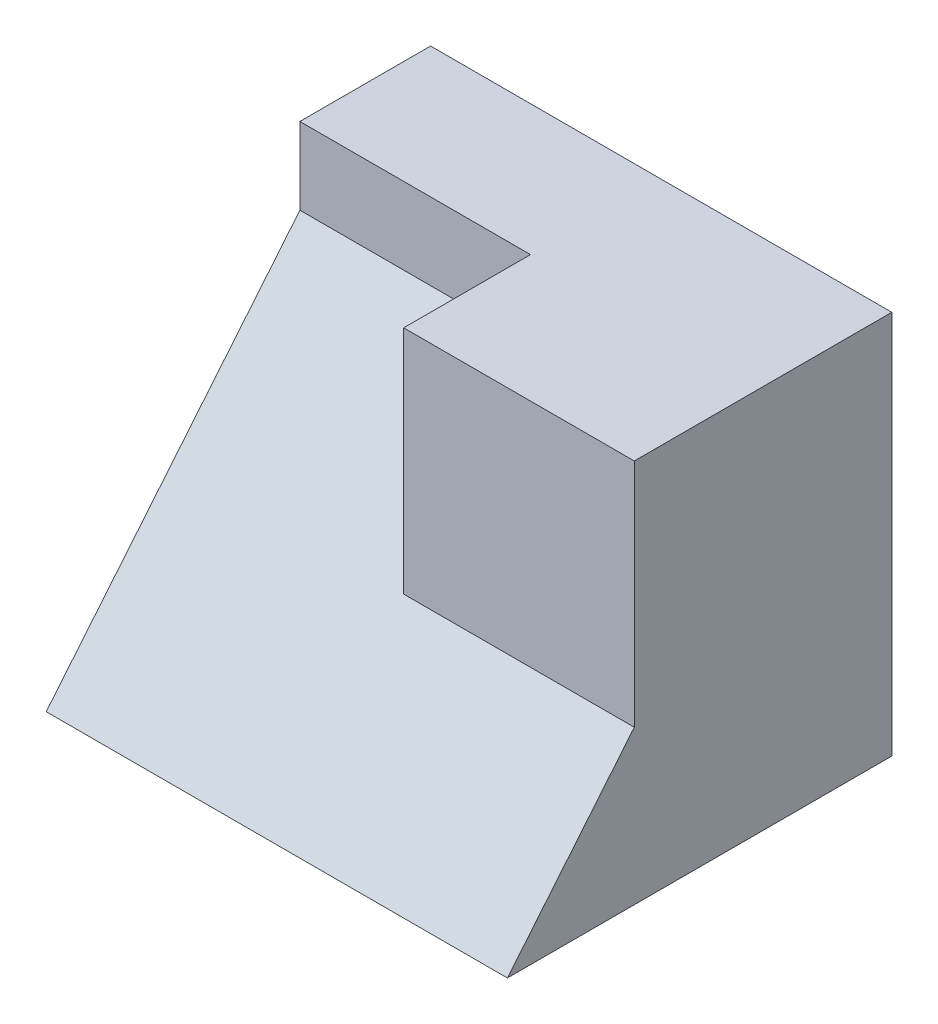
ISO-10303-21;
HEADER;
FILE_DESCRIPTION(('STEP AP214'),'2;1');
FILE_NAME('part.step','',(''),(''),'','','');
FILE_SCHEMA(('AUTOMOTIVE_DESIGN { 1 0 10303 214 1 1 1 1 }'));
ENDSEC;
DATA;
#1=APPLICATION_CONTEXT('core data for automotive mechanical design processes');
#2=APPLICATION_PROTOCOL_DEFINITION('international standard','automotive_design',2000,#1);
#3=PRODUCT_CONTEXT('',#1,'mechanical');
#4=PRODUCT('Part','Part','',(#3));
#5=PRODUCT_RELATED_PRODUCT_CATEGORY('part','',(#4));
#6=PRODUCT_DEFINITION_FORMATION('','',#4);
#7=PRODUCT_DEFINITION_CONTEXT('part definition',#1,'design');
#8=PRODUCT_DEFINITION('design','',#6,#7);
#9=PRODUCT_DEFINITION_SHAPE('','',#8);
#10=(LENGTH_UNIT() NAMED_UNIT(*) SI_UNIT(.MILLI.,.METRE.));
#11=(NAMED_UNIT(*) PLANE_ANGLE_UNIT() SI_UNIT($,.RADIAN.));
#12=(NAMED_UNIT(*) SI_UNIT($,.STERADIAN.) SOLID_ANGLE_UNIT());
#13=UNCERTAINTY_MEASURE_WITH_UNIT(LENGTH_MEASURE(1.E-05),#10,'distance_accuracy_value','');
#14=(GEOMETRIC_REPRESENTATION_CONTEXT(3) GLOBAL_UNCERTAINTY_ASSIGNED_CONTEXT((#13)) GLOBAL_UNIT_ASSIGNED_CONTEXT((#10,
#11,#12)) REPRESENTATION_CONTEXT('',''));
#15=CARTESIAN_POINT('',(0.,0.,0.));
#16=DIRECTION('',(0.,0.,1.));
#17=DIRECTION('',(1.,0.,0.));
#18=AXIS2_PLACEMENT_3D('',#15,#16,#17);
#19=CARTESIAN_POINT('',(0.,0.,50.));
#20=DIRECTION('',(1.,0.,0.));
#21=DIRECTION('',(0.,0.,-1.));
#22=AXIS2_PLACEMENT_3D('',#19,#20,#21);
#23=PLANE('',#22);
#24=DIRECTION('',(0.,0.771373278540077,-0.636382954795564));
#25=VECTOR('',#24,1.);
#26=CARTESIAN_POINT('',(0.,40.,17.));
#27=LINE('',#26,#25);
#28=CARTESIAN_POINT('',(0.,0.,50.));
#29=VERTEX_POINT('',#28);
#30=CARTESIAN_POINT('',(0.,40.,17.));
#31=VERTEX_POINT('',#30);
#32=EDGE_CURVE('E122',#29,#31,#27,.T.);
#33=ORIENTED_EDGE('',*,*,#32,.T.);
#34=DIRECTION('',(0.,-1.,0.));
#35=VECTOR('',#34,1.);
#36=CARTESIAN_POINT('',(0.,50.,17.));
#37=LINE('',#36,#35);
#38=CARTESIAN_POINT('',(0.,50.,17.));
#39=VERTEX_POINT('',#38);
#40=EDGE_CURVE('E128',#39,#31,#37,.T.);
#41=ORIENTED_EDGE('',*,*,#40,.F.);
#42=DIRECTION('',(0.,0.,-1.));
#43=VECTOR('',#42,1.);
#44=CARTESIAN_POINT('',(0.,50.,50.));
#45=LINE('',#44,#43);
#46=CARTESIAN_POINT('',(0.,50.,0.));
#47=VERTEX_POINT('',#46);
#48=EDGE_CURVE('E57',#39,#47,#45,.T.);
#49=ORIENTED_EDGE('',*,*,#48,.T.);
#50=DIRECTION('',(0.,-1.,0.));
#51=VECTOR('',#50,1.);
#52=CARTESIAN_POINT('',(0.,0.,0.));
#53=LINE('',#52,#51);
#54=CARTESIAN_POINT('',(0.,0.,0.));
#55=VERTEX_POINT('',#54);
#56=EDGE_CURVE('E139',#47,#55,#53,.T.);
#57=ORIENTED_EDGE('',*,*,#56,.T.);
#58=DIRECTION('',(0.,0.,-1.));
#59=VECTOR('',#58,1.);
#60=CARTESIAN_POINT('',(0.,0.,50.));
#61=LINE('',#60,#59);
#62=EDGE_CURVE('E11',#29,#55,#61,.T.);
#63=ORIENTED_EDGE('',*,*,#62,.F.);
#64=EDGE_LOOP('',(#33,#41,#49,#57,#63));
#65=FACE_BOUND('',#64,.T.);
#66=ADVANCED_FACE('F35',(#65),#23,.F.);
#67=CARTESIAN_POINT('',(0.,0.,50.));
#68=DIRECTION('',(0.,1.,0.));
#69=DIRECTION('',(0.,0.,1.));
#70=AXIS2_PLACEMENT_3D('',#67,#68,#69);
#71=PLANE('',#70);
#72=DIRECTION('',(1.,0.,0.));
#73=VECTOR('',#72,1.);
#74=CARTESIAN_POINT('',(0.,0.,0.));
#75=LINE('',#74,#73);
#76=CARTESIAN_POINT('',(60.,0.,0.));
#77=VERTEX_POINT('',#76);
#78=EDGE_CURVE('E143',#55,#77,#75,.T.);
#79=ORIENTED_EDGE('',*,*,#78,.T.);
#80=DIRECTION('',(0.,0.,-1.));
#81=VECTOR('',#80,1.);
#82=CARTESIAN_POINT('',(60.,0.,50.));
#83=LINE('',#82,#81);
#84=CARTESIAN_POINT('',(60.,0.,50.));
#85=VERTEX_POINT('',#84);
#86=EDGE_CURVE('E42',#85,#77,#83,.T.);
#87=ORIENTED_EDGE('',*,*,#86,.F.);
#88=DIRECTION('',(1.,0.,0.));
#89=VECTOR('',#88,1.);
#90=CARTESIAN_POINT('',(0.,0.,50.));
#91=LINE('',#90,#89);
#92=EDGE_CURVE('E119',#29,#85,#91,.T.);
#93=ORIENTED_EDGE('',*,*,#92,.F.);
#94=ORIENTED_EDGE('',*,*,#62,.T.);
#95=EDGE_LOOP('',(#79,#87,#93,#94));
#96=FACE_BOUND('',#95,.T.);
#97=ADVANCED_FACE('F172',(#96),#71,.F.);
#98=CARTESIAN_POINT('',(60.,0.,50.));
#99=DIRECTION('',(-1.,0.,0.));
#100=DIRECTION('',(0.,0.,1.));
#101=AXIS2_PLACEMENT_3D('',#98,#99,#100);
#102=PLANE('',#101);
#103=DIRECTION('',(0.,1.,0.));
#104=VECTOR('',#103,1.);
#105=CARTESIAN_POINT('',(60.,50.,33.5));
#106=LINE('',#105,#104);
#107=CARTESIAN_POINT('',(60.,20.,33.5));
#108=VERTEX_POINT('',#107);
#109=CARTESIAN_POINT('',(60.,50.,33.5));
#110=VERTEX_POINT('',#109);
#111=EDGE_CURVE('E100',#108,#110,#106,.T.);
#112=ORIENTED_EDGE('',*,*,#111,.F.);
#113=DIRECTION('',(0.,-0.771373278540077,0.636382954795564));
#114=VECTOR('',#113,1.);
#115=CARTESIAN_POINT('',(60.,0.,50.));
#116=LINE('',#115,#114);
#117=EDGE_CURVE('E106',#108,#85,#116,.T.);
#118=ORIENTED_EDGE('',*,*,#117,.T.);
#119=ORIENTED_EDGE('',*,*,#86,.T.);
#120=DIRECTION('',(0.,1.,0.));
#121=VECTOR('',#120,1.);
#122=CARTESIAN_POINT('',(60.,0.,0.));
#123=LINE('',#122,#121);
#124=CARTESIAN_POINT('',(60.,50.,0.));
#125=VERTEX_POINT('',#124);
#126=EDGE_CURVE('E145',#77,#125,#123,.T.);
#127=ORIENTED_EDGE('',*,*,#126,.T.);
#128=DIRECTION('',(0.,0.,-1.));
#129=VECTOR('',#128,1.);
#130=CARTESIAN_POINT('',(60.,50.,50.));
#131=LINE('',#130,#129);
#132=EDGE_CURVE('E115',#110,#125,#131,.T.);
#133=ORIENTED_EDGE('',*,*,#132,.F.);
#134=EDGE_LOOP('',(#112,#118,#119,#127,#133));
#135=FACE_BOUND('',#134,.T.);
#136=ADVANCED_FACE('F111',(#135),#102,.F.);
#137=CARTESIAN_POINT('',(0.,50.,50.));
#138=DIRECTION('',(0.,-1.,0.));
#139=DIRECTION('',(0.,0.,-1.));
#140=AXIS2_PLACEMENT_3D('',#137,#138,#139);
#141=PLANE('',#140);
#142=DIRECTION('',(-1.,0.,0.));
#143=VECTOR('',#142,1.);
#144=CARTESIAN_POINT('',(0.,50.,17.));
#145=LINE('',#144,#143);
#146=CARTESIAN_POINT('',(30.,50.,17.));
#147=VERTEX_POINT('',#146);
#148=EDGE_CURVE('E135',#147,#39,#145,.T.);
#149=ORIENTED_EDGE('',*,*,#148,.F.);
#150=DIRECTION('',(0.,0.,1.));
#151=VECTOR('',#150,1.);
#152=CARTESIAN_POINT('',(30.,50.,10.));
#153=LINE('',#152,#151);
#154=CARTESIAN_POINT('',(30.,50.,33.5));
#155=VERTEX_POINT('',#154);
#156=EDGE_CURVE('E49',#147,#155,#153,.T.);
#157=ORIENTED_EDGE('',*,*,#156,.T.);
#158=DIRECTION('',(-1.,0.,0.));
#159=VECTOR('',#158,1.);
#160=CARTESIAN_POINT('',(30.,50.,33.5));
#161=LINE('',#160,#159);
#162=EDGE_CURVE('E107',#110,#155,#161,.T.);
#163=ORIENTED_EDGE('',*,*,#162,.F.);
#164=ORIENTED_EDGE('',*,*,#132,.T.);
#165=DIRECTION('',(-1.,0.,0.));
#166=VECTOR('',#165,1.);
#167=CARTESIAN_POINT('',(0.,50.,0.));
#168=LINE('',#167,#166);
#169=EDGE_CURVE('E141',#125,#47,#168,.T.);
#170=ORIENTED_EDGE('',*,*,#169,.T.);
#171=ORIENTED_EDGE('',*,*,#48,.F.);
#172=EDGE_LOOP('',(#149,#157,#163,#164,#170,#171));
#173=FACE_BOUND('',#172,.T.);
#174=ADVANCED_FACE('F157',(#173),#141,.F.);
#175=CARTESIAN_POINT('',(0.,0.,0.));
#176=DIRECTION('',(0.,0.,-1.));
#177=DIRECTION('',(-1.,0.,0.));
#178=AXIS2_PLACEMENT_3D('',#175,#176,#177);
#179=PLANE('',#178);
#180=ORIENTED_EDGE('',*,*,#56,.F.);
#181=ORIENTED_EDGE('',*,*,#169,.F.);
#182=ORIENTED_EDGE('',*,*,#126,.F.);
#183=ORIENTED_EDGE('',*,*,#78,.F.);
#184=EDGE_LOOP('',(#180,#181,#182,#183));
#185=FACE_BOUND('',#184,.T.);
#186=ADVANCED_FACE('F154',(#185),#179,.T.);
#187=CARTESIAN_POINT('',(30.,50.,10.));
#188=DIRECTION('',(1.,0.,0.));
#189=DIRECTION('',(0.,1.,0.));
#190=AXIS2_PLACEMENT_3D('',#187,#188,#189);
#191=PLANE('',#190);
#192=ORIENTED_EDGE('',*,*,#156,.F.);
#193=DIRECTION('',(0.,1.,0.));
#194=VECTOR('',#193,1.);
#195=CARTESIAN_POINT('',(30.,50.,17.));
#196=LINE('',#195,#194);
#197=CARTESIAN_POINT('',(30.,40.,17.));
#198=VERTEX_POINT('',#197);
#199=EDGE_CURVE('E133',#198,#147,#196,.T.);
#200=ORIENTED_EDGE('',*,*,#199,.F.);
#201=DIRECTION('',(0.,-0.771373278540077,0.636382954795564));
#202=VECTOR('',#201,1.);
#203=CARTESIAN_POINT('',(30.,0.,50.));
#204=LINE('',#203,#202);
#205=CARTESIAN_POINT('',(30.,20.,33.5));
#206=VERTEX_POINT('',#205);
#207=EDGE_CURVE('E120',#198,#206,#204,.T.);
#208=ORIENTED_EDGE('',*,*,#207,.T.);
#209=DIRECTION('',(0.,-1.,0.));
#210=VECTOR('',#209,1.);
#211=CARTESIAN_POINT('',(30.,50.,33.5));
#212=LINE('',#211,#210);
#213=EDGE_CURVE('E102',#155,#206,#212,.T.);
#214=ORIENTED_EDGE('',*,*,#213,.F.);
#215=EDGE_LOOP('',(#192,#200,#208,#214));
#216=FACE_BOUND('',#215,.T.);
#217=ADVANCED_FACE('F159',(#216),#191,.F.);
#218=CARTESIAN_POINT('',(0.,0.,17.));
#219=DIRECTION('',(0.,0.,1.));
#220=DIRECTION('',(1.,0.,0.));
#221=AXIS2_PLACEMENT_3D('',#218,#219,#220);
#222=PLANE('',#221);
#223=ORIENTED_EDGE('',*,*,#40,.T.);
#224=DIRECTION('',(1.,0.,0.));
#225=VECTOR('',#224,1.);
#226=CARTESIAN_POINT('',(0.,40.,17.));
#227=LINE('',#226,#225);
#228=EDGE_CURVE('E131',#31,#198,#227,.T.);
#229=ORIENTED_EDGE('',*,*,#228,.T.);
#230=ORIENTED_EDGE('',*,*,#199,.T.);
#231=ORIENTED_EDGE('',*,*,#148,.T.);
#232=EDGE_LOOP('',(#223,#229,#230,#231));
#233=FACE_BOUND('',#232,.T.);
#234=ADVANCED_FACE('F162',(#233),#222,.T.);
#235=CARTESIAN_POINT('',(10.,40.,17.));
#236=DIRECTION('',(0.,0.636382954795564,0.771373278540077));
#237=DIRECTION('',(0.,-0.771373278540077,0.636382954795564));
#238=AXIS2_PLACEMENT_3D('',#235,#236,#237);
#239=PLANE('',#238);
#240=ORIENTED_EDGE('',*,*,#32,.F.);
#241=ORIENTED_EDGE('',*,*,#92,.T.);
#242=ORIENTED_EDGE('',*,*,#117,.F.);
#243=DIRECTION('',(-1.,0.,0.));
#244=VECTOR('',#243,1.);
#245=CARTESIAN_POINT('',(82.,20.,33.5));
#246=LINE('',#245,#244);
#247=EDGE_CURVE('E96',#108,#206,#246,.T.);
#248=ORIENTED_EDGE('',*,*,#247,.T.);
#249=ORIENTED_EDGE('',*,*,#207,.F.);
#250=ORIENTED_EDGE('',*,*,#228,.F.);
#251=EDGE_LOOP('',(#240,#241,#242,#248,#249,#250));
#252=FACE_BOUND('',#251,.T.);
#253=ADVANCED_FACE('F117',(#252),#239,.T.);
#254=CARTESIAN_POINT('',(0.,0.,33.5));
#255=DIRECTION('',(0.,0.,1.));
#256=DIRECTION('',(1.,0.,0.));
#257=AXIS2_PLACEMENT_3D('',#254,#255,#256);
#258=PLANE('',#257);
#259=ORIENTED_EDGE('',*,*,#213,.T.);
#260=ORIENTED_EDGE('',*,*,#247,.F.);
#261=ORIENTED_EDGE('',*,*,#111,.T.);
#262=ORIENTED_EDGE('',*,*,#162,.T.);
#263=EDGE_LOOP('',(#259,#260,#261,#262));
#264=FACE_BOUND('',#263,.T.);
#265=ADVANCED_FACE('F98',(#264),#258,.T.);
#266=CLOSED_SHELL('',(#66,#97,#136,#174,#186,#217,#234,#253,#265));
#267=MANIFOLD_SOLID_BREP('B2',#266);
#268=ADVANCED_BREP_SHAPE_REPRESENTATION('',(#18,#267),#14);
#269=SHAPE_DEFINITION_REPRESENTATION(#9,#268);
ENDSEC;
END-ISO-10303-21;
